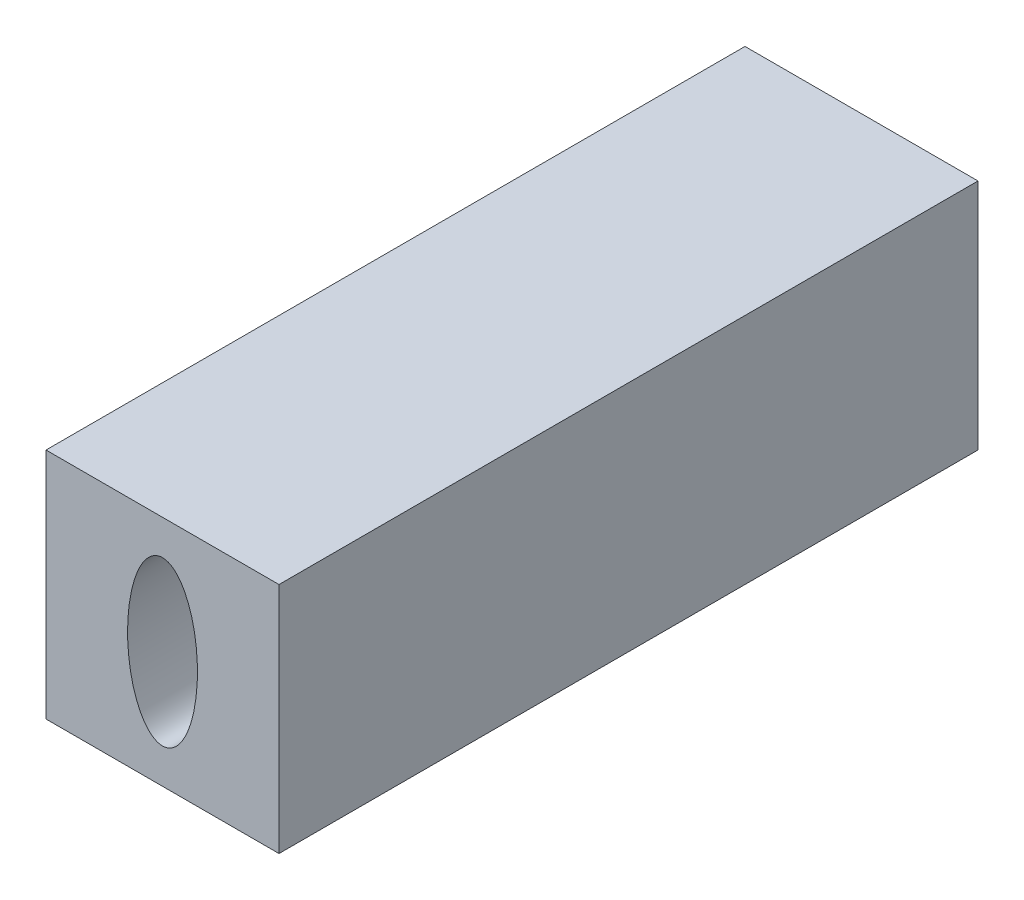
ISO-10303-21;
HEADER;
FILE_DESCRIPTION(('STEP AP214'),'2;1');
FILE_NAME('part.step','',(''),(''),'','','');
FILE_SCHEMA(('AUTOMOTIVE_DESIGN { 1 0 10303 214 1 1 1 1 }'));
ENDSEC;
DATA;
#1=APPLICATION_CONTEXT('core data for automotive mechanical design processes');
#2=APPLICATION_PROTOCOL_DEFINITION('international standard','automotive_design',2000,#1);
#3=PRODUCT_CONTEXT('',#1,'mechanical');
#4=PRODUCT('Part','Part','',(#3));
#5=PRODUCT_RELATED_PRODUCT_CATEGORY('part','',(#4));
#6=PRODUCT_DEFINITION_FORMATION('','',#4);
#7=PRODUCT_DEFINITION_CONTEXT('part definition',#1,'design');
#8=PRODUCT_DEFINITION('design','',#6,#7);
#9=PRODUCT_DEFINITION_SHAPE('','',#8);
#10=(LENGTH_UNIT() NAMED_UNIT(*) SI_UNIT(.MILLI.,.METRE.));
#11=(NAMED_UNIT(*) PLANE_ANGLE_UNIT() SI_UNIT($,.RADIAN.));
#12=(NAMED_UNIT(*) SI_UNIT($,.STERADIAN.) SOLID_ANGLE_UNIT());
#13=UNCERTAINTY_MEASURE_WITH_UNIT(LENGTH_MEASURE(1.E-05),#10,'distance_accuracy_value','');
#14=(GEOMETRIC_REPRESENTATION_CONTEXT(3) GLOBAL_UNCERTAINTY_ASSIGNED_CONTEXT((#13)) GLOBAL_UNIT_ASSIGNED_CONTEXT((#10,
#11,#12)) REPRESENTATION_CONTEXT('',''));
#15=CARTESIAN_POINT('',(0.,0.,0.));
#16=DIRECTION('',(0.,0.,1.));
#17=DIRECTION('',(1.,0.,0.));
#18=AXIS2_PLACEMENT_3D('',#15,#16,#17);
#19=CARTESIAN_POINT('',(0.,0.,-3000.));
#20=DIRECTION('',(-1.,0.,0.));
#21=DIRECTION('',(0.,0.,1.));
#22=AXIS2_PLACEMENT_3D('',#19,#20,#21);
#23=PLANE('',#22);
#24=DIRECTION('',(0.,-1.,0.));
#25=VECTOR('',#24,1.);
#26=CARTESIAN_POINT('',(0.,0.,0.));
#27=LINE('',#26,#25);
#28=CARTESIAN_POINT('',(0.,1000.,0.));
#29=VERTEX_POINT('',#28);
#30=CARTESIAN_POINT('',(0.,0.,0.));
#31=VERTEX_POINT('',#30);
#32=EDGE_CURVE('E389',#29,#31,#27,.T.);
#33=ORIENTED_EDGE('',*,*,#32,.F.);
#34=DIRECTION('',(0.,0.,1.));
#35=VECTOR('',#34,1.);
#36=CARTESIAN_POINT('',(0.,1000.,-3000.));
#37=LINE('',#36,#35);
#38=CARTESIAN_POINT('',(0.,1000.,-3000.));
#39=VERTEX_POINT('',#38);
#40=EDGE_CURVE('E11',#39,#29,#37,.T.);
#41=ORIENTED_EDGE('',*,*,#40,.F.);
#42=DIRECTION('',(0.,-1.,0.));
#43=VECTOR('',#42,1.);
#44=CARTESIAN_POINT('',(0.,0.,-3000.));
#45=LINE('',#44,#43);
#46=CARTESIAN_POINT('',(0.,0.,-3000.));
#47=VERTEX_POINT('',#46);
#48=EDGE_CURVE('E391',#39,#47,#45,.T.);
#49=ORIENTED_EDGE('',*,*,#48,.T.);
#50=DIRECTION('',(0.,0.,1.));
#51=VECTOR('',#50,1.);
#52=CARTESIAN_POINT('',(0.,0.,-3000.));
#53=LINE('',#52,#51);
#54=EDGE_CURVE('E352',#47,#31,#53,.T.);
#55=ORIENTED_EDGE('',*,*,#54,.T.);
#56=EDGE_LOOP('',(#33,#41,#49,#55));
#57=FACE_BOUND('',#56,.T.);
#58=ADVANCED_FACE('F349',(#57),#23,.T.);
#59=CARTESIAN_POINT('',(0.,1000.,-3000.));
#60=DIRECTION('',(0.,1.,0.));
#61=DIRECTION('',(0.,0.,1.));
#62=AXIS2_PLACEMENT_3D('',#59,#60,#61);
#63=PLANE('',#62);
#64=DIRECTION('',(-1.,0.,0.));
#65=VECTOR('',#64,1.);
#66=CARTESIAN_POINT('',(0.,1000.,0.));
#67=LINE('',#66,#65);
#68=CARTESIAN_POINT('',(1000.,1000.,0.));
#69=VERTEX_POINT('',#68);
#70=EDGE_CURVE('E406',#69,#29,#67,.T.);
#71=ORIENTED_EDGE('',*,*,#70,.F.);
#72=DIRECTION('',(0.,0.,1.));
#73=VECTOR('',#72,1.);
#74=CARTESIAN_POINT('',(1000.,1000.,-3000.));
#75=LINE('',#74,#73);
#76=CARTESIAN_POINT('',(1000.,1000.,-3000.));
#77=VERTEX_POINT('',#76);
#78=EDGE_CURVE('E357',#77,#69,#75,.T.);
#79=ORIENTED_EDGE('',*,*,#78,.F.);
#80=DIRECTION('',(-1.,0.,0.));
#81=VECTOR('',#80,1.);
#82=CARTESIAN_POINT('',(0.,1000.,-3000.));
#83=LINE('',#82,#81);
#84=EDGE_CURVE('E396',#77,#39,#83,.T.);
#85=ORIENTED_EDGE('',*,*,#84,.T.);
#86=ORIENTED_EDGE('',*,*,#40,.T.);
#87=EDGE_LOOP('',(#71,#79,#85,#86));
#88=FACE_BOUND('',#87,.T.);
#89=ADVANCED_FACE('F427',(#88),#63,.T.);
#90=CARTESIAN_POINT('',(1000.,0.,-3000.));
#91=DIRECTION('',(1.,0.,0.));
#92=DIRECTION('',(0.,0.,-1.));
#93=AXIS2_PLACEMENT_3D('',#90,#91,#92);
#94=PLANE('',#93);
#95=DIRECTION('',(0.,1.,0.));
#96=VECTOR('',#95,1.);
#97=CARTESIAN_POINT('',(1000.,0.,0.));
#98=LINE('',#97,#96);
#99=CARTESIAN_POINT('',(1000.,0.,0.));
#100=VERTEX_POINT('',#99);
#101=EDGE_CURVE('E403',#100,#69,#98,.T.);
#102=ORIENTED_EDGE('',*,*,#101,.F.);
#103=DIRECTION('',(0.,0.,1.));
#104=VECTOR('',#103,1.);
#105=CARTESIAN_POINT('',(1000.,0.,-3000.));
#106=LINE('',#105,#104);
#107=CARTESIAN_POINT('',(1000.,0.,-3000.));
#108=VERTEX_POINT('',#107);
#109=EDGE_CURVE('E395',#108,#100,#106,.T.);
#110=ORIENTED_EDGE('',*,*,#109,.F.);
#111=DIRECTION('',(0.,1.,0.));
#112=VECTOR('',#111,1.);
#113=CARTESIAN_POINT('',(1000.,0.,-3000.));
#114=LINE('',#113,#112);
#115=EDGE_CURVE('E420',#108,#77,#114,.T.);
#116=ORIENTED_EDGE('',*,*,#115,.T.);
#117=ORIENTED_EDGE('',*,*,#78,.T.);
#118=EDGE_LOOP('',(#102,#110,#116,#117));
#119=FACE_BOUND('',#118,.T.);
#120=ADVANCED_FACE('F424',(#119),#94,.T.);
#121=CARTESIAN_POINT('',(0.,0.,-3000.));
#122=DIRECTION('',(0.,-1.,0.));
#123=DIRECTION('',(0.,0.,-1.));
#124=AXIS2_PLACEMENT_3D('',#121,#122,#123);
#125=PLANE('',#124);
#126=DIRECTION('',(1.,0.,0.));
#127=VECTOR('',#126,1.);
#128=CARTESIAN_POINT('',(0.,0.,0.));
#129=LINE('',#128,#127);
#130=EDGE_CURVE('E398',#31,#100,#129,.T.);
#131=ORIENTED_EDGE('',*,*,#130,.F.);
#132=ORIENTED_EDGE('',*,*,#54,.F.);
#133=DIRECTION('',(1.,0.,0.));
#134=VECTOR('',#133,1.);
#135=CARTESIAN_POINT('',(0.,0.,-3000.));
#136=LINE('',#135,#134);
#137=EDGE_CURVE('E418',#47,#108,#136,.T.);
#138=ORIENTED_EDGE('',*,*,#137,.T.);
#139=ORIENTED_EDGE('',*,*,#109,.T.);
#140=EDGE_LOOP('',(#131,#132,#138,#139));
#141=FACE_BOUND('',#140,.T.);
#142=ADVANCED_FACE('F399',(#141),#125,.T.);
#143=CARTESIAN_POINT('',(0.,1000.,-3000.));
#144=DIRECTION('',(0.,0.,-1.));
#145=DIRECTION('',(-1.,0.,0.));
#146=AXIS2_PLACEMENT_3D('',#143,#144,#145);
#147=PLANE('',#146);
#148=CARTESIAN_POINT('',(500.,500.,-3000.));
#149=DIRECTION('',(0.,0.,1.));
#150=DIRECTION('',(0.,1.,0.));
#151=AXIS2_PLACEMENT_3D('',#148,#149,#150);
#152=ELLIPSE('',#151,350.,150.);
#153=CARTESIAN_POINT('',(500.,850.,-3000.));
#154=VERTEX_POINT('',#153);
#155=EDGE_CURVE('E407',#154,#154,#152,.T.);
#156=ORIENTED_EDGE('',*,*,#155,.T.);
#157=EDGE_LOOP('',(#156));
#158=FACE_BOUND('',#157,.T.);
#159=ORIENTED_EDGE('',*,*,#48,.F.);
#160=ORIENTED_EDGE('',*,*,#84,.F.);
#161=ORIENTED_EDGE('',*,*,#115,.F.);
#162=ORIENTED_EDGE('',*,*,#137,.F.);
#163=EDGE_LOOP('',(#159,#160,#161,#162));
#164=FACE_BOUND('',#163,.T.);
#165=ADVANCED_FACE('F429',(#158,#164),#147,.T.);
#166=CARTESIAN_POINT('',(0.,1000.,0.));
#167=DIRECTION('',(0.,0.,-1.));
#168=DIRECTION('',(-1.,0.,0.));
#169=AXIS2_PLACEMENT_3D('',#166,#167,#168);
#170=PLANE('',#169);
#171=CARTESIAN_POINT('',(500.,500.,0.));
#172=DIRECTION('',(0.,0.,1.));
#173=DIRECTION('',(0.,1.,0.));
#174=AXIS2_PLACEMENT_3D('',#171,#172,#173);
#175=ELLIPSE('',#174,350.,150.);
#176=CARTESIAN_POINT('',(500.,850.,0.));
#177=VERTEX_POINT('',#176);
#178=EDGE_CURVE('E410',#177,#177,#175,.T.);
#179=ORIENTED_EDGE('',*,*,#178,.F.);
#180=EDGE_LOOP('',(#179));
#181=FACE_BOUND('',#180,.T.);
#182=ORIENTED_EDGE('',*,*,#32,.T.);
#183=ORIENTED_EDGE('',*,*,#130,.T.);
#184=ORIENTED_EDGE('',*,*,#101,.T.);
#185=ORIENTED_EDGE('',*,*,#70,.T.);
#186=EDGE_LOOP('',(#182,#183,#184,#185));
#187=FACE_BOUND('',#186,.T.);
#188=ADVANCED_FACE('F405',(#181,#187),#170,.F.);
#189=DIRECTION('',(0.,0.,1.));
#190=VECTOR('',#189,1.);
#191=SURFACE_OF_LINEAR_EXTRUSION('',#152,#190);
#192=ORIENTED_EDGE('',*,*,#155,.F.);
#193=EDGE_LOOP('',(#192));
#194=FACE_BOUND('',#193,.T.);
#195=ORIENTED_EDGE('',*,*,#178,.T.);
#196=EDGE_LOOP('',(#195));
#197=FACE_BOUND('',#196,.T.);
#198=ADVANCED_FACE('F437',(#194,#197),#191,.F.);
#199=CLOSED_SHELL('',(#58,#89,#120,#142,#165,#188,#198));
#200=MANIFOLD_SOLID_BREP('B2',#199);
#201=ADVANCED_BREP_SHAPE_REPRESENTATION('',(#18,#200),#14);
#202=SHAPE_DEFINITION_REPRESENTATION(#9,#201);
ENDSEC;
END-ISO-10303-21;
